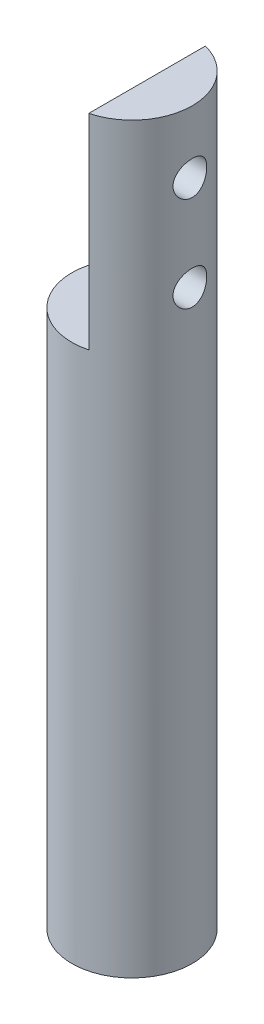
ISO-10303-21;
HEADER;
FILE_DESCRIPTION(('STEP AP214'),'2;1');
FILE_NAME('part.step','',(''),(''),'','','');
FILE_SCHEMA(('AUTOMOTIVE_DESIGN { 1 0 10303 214 1 1 1 1 }'));
ENDSEC;
DATA;
#1=APPLICATION_CONTEXT('core data for automotive mechanical design processes');
#2=APPLICATION_PROTOCOL_DEFINITION('international standard','automotive_design',2000,#1);
#3=PRODUCT_CONTEXT('',#1,'mechanical');
#4=PRODUCT('Part','Part','',(#3));
#5=PRODUCT_RELATED_PRODUCT_CATEGORY('part','',(#4));
#6=PRODUCT_DEFINITION_FORMATION('','',#4);
#7=PRODUCT_DEFINITION_CONTEXT('part definition',#1,'design');
#8=PRODUCT_DEFINITION('design','',#6,#7);
#9=PRODUCT_DEFINITION_SHAPE('','',#8);
#10=(LENGTH_UNIT() NAMED_UNIT(*) SI_UNIT(.MILLI.,.METRE.));
#11=(NAMED_UNIT(*) PLANE_ANGLE_UNIT() SI_UNIT($,.RADIAN.));
#12=(NAMED_UNIT(*) SI_UNIT($,.STERADIAN.) SOLID_ANGLE_UNIT());
#13=UNCERTAINTY_MEASURE_WITH_UNIT(LENGTH_MEASURE(1.E-05),#10,'distance_accuracy_value','');
#14=(GEOMETRIC_REPRESENTATION_CONTEXT(3) GLOBAL_UNCERTAINTY_ASSIGNED_CONTEXT((#13)) GLOBAL_UNIT_ASSIGNED_CONTEXT((#10,
#11,#12)) REPRESENTATION_CONTEXT('',''));
#15=CARTESIAN_POINT('',(0.,0.,0.));
#16=DIRECTION('',(0.,0.,1.));
#17=DIRECTION('',(1.,0.,0.));
#18=AXIS2_PLACEMENT_3D('',#15,#16,#17);
#19=CARTESIAN_POINT('',(0.,57.15,0.));
#20=DIRECTION('',(0.,-1.,0.));
#21=DIRECTION('',(0.,0.,-1.));
#22=AXIS2_PLACEMENT_3D('',#19,#20,#21);
#23=CYLINDRICAL_SURFACE('',#22,3.175);
#24=CARTESIAN_POINT('',(0.,57.15,0.));
#25=DIRECTION('',(0.,1.,0.));
#26=DIRECTION('',(0.,0.,1.));
#27=AXIS2_PLACEMENT_3D('',#24,#25,#26);
#28=CIRCLE('',#27,3.175);
#29=CARTESIAN_POINT('',(0.794,57.15,3.07411597048648));
#30=VERTEX_POINT('',#29);
#31=CARTESIAN_POINT('',(0.794,57.15,-3.07411597048648));
#32=VERTEX_POINT('',#31);
#33=EDGE_CURVE('E68',#30,#32,#28,.T.);
#34=ORIENTED_EDGE('',*,*,#33,.F.);
#35=DIRECTION('',(0.,-1.,0.));
#36=VECTOR('',#35,1.);
#37=CARTESIAN_POINT('',(0.794,57.15,3.07411597048648));
#38=LINE('',#37,#36);
#39=CARTESIAN_POINT('',(0.794,46.355,3.07411597048648));
#40=VERTEX_POINT('',#39);
#41=EDGE_CURVE('E52',#30,#40,#38,.T.);
#42=ORIENTED_EDGE('',*,*,#41,.T.);
#43=CARTESIAN_POINT('',(0.,46.355,0.));
#44=DIRECTION('',(0.,-1.,0.));
#45=DIRECTION('',(0.,0.,-1.));
#46=AXIS2_PLACEMENT_3D('',#43,#44,#45);
#47=CIRCLE('',#46,3.175);
#48=CARTESIAN_POINT('',(0.794,46.355,-3.07411597048648));
#49=VERTEX_POINT('',#48);
#50=EDGE_CURVE('E11',#40,#49,#47,.T.);
#51=ORIENTED_EDGE('',*,*,#50,.T.);
#52=DIRECTION('',(0.,-1.,0.));
#53=VECTOR('',#52,1.);
#54=CARTESIAN_POINT('',(0.794,57.15,-3.07411597048648));
#55=LINE('',#54,#53);
#56=EDGE_CURVE('E63',#49,#32,#55,.F.);
#57=ORIENTED_EDGE('',*,*,#56,.T.);
#58=EDGE_LOOP('',(#34,#42,#51,#57));
#59=FACE_BOUND('',#58,.T.);
#60=CARTESIAN_POINT('',(3.048,48.855,0.889));
#61=CARTESIAN_POINT('',(3.04800074144579,48.9038733654637,0.888999022704976));
#62=CARTESIAN_POINT('',(3.0491883536904,48.9527567364062,0.884956005900081));
#63=CARTESIAN_POINT('',(3.05379446473852,49.0491049848988,0.868925614211581));
#64=CARTESIAN_POINT('',(3.05721393512249,49.096569235257,0.856934779420127));
#65=CARTESIAN_POINT('',(3.06586679255467,49.1886712317961,0.825439260264913));
#66=CARTESIAN_POINT('',(3.07109744934927,49.2333131134177,0.80594588062788));
#67=CARTESIAN_POINT('',(3.08277975485952,49.3187015211283,0.760034756365591));
#68=CARTESIAN_POINT('',(3.0892315334209,49.3594476322734,0.733616275257372));
#69=CARTESIAN_POINT('',(3.10282851808416,49.4370111447716,0.673825649223519));
#70=CARTESIAN_POINT('',(3.10998700385331,49.4737052421073,0.640296533333315));
#71=CARTESIAN_POINT('',(3.12407666925912,49.5410299343499,0.567573542210273));
#72=CARTESIAN_POINT('',(3.13100782316884,49.5716598449399,0.528379028524615));
#73=CARTESIAN_POINT('',(3.14401109305889,49.6265090608122,0.444574237503616));
#74=CARTESIAN_POINT('',(3.15006572408435,49.6506045660182,0.399879985189847));
#75=CARTESIAN_POINT('',(3.16048064645674,49.6908915244846,0.306876342799879));
#76=CARTESIAN_POINT('',(3.16484125401579,49.7070844530113,0.25856762942083));
#77=CARTESIAN_POINT('',(3.17128288506878,49.7307040631926,0.160994613397917));
#78=CARTESIAN_POINT('',(3.17341843142117,49.7383407786606,0.111784817223569));
#79=CARTESIAN_POINT('',(3.17536048694193,49.7452932743306,0.0127392624770652));
#80=CARTESIAN_POINT('',(3.17516742430905,49.7446105843552,-0.0370963793271478));
#81=CARTESIAN_POINT('',(3.17251342098985,49.735088882728,-0.134512605209552));
#82=CARTESIAN_POINT('',(3.17011563326432,49.7264769888744,-0.182117374688842));
#83=CARTESIAN_POINT('',(3.16339697389186,49.7017098300263,-0.275176901920624));
#84=CARTESIAN_POINT('',(3.15907598732543,49.6855541142527,-0.320631531013265));
#85=CARTESIAN_POINT('',(3.14890524255914,49.6459918167282,-0.408664749201556));
#86=CARTESIAN_POINT('',(3.14303970776309,49.6225099164607,-0.451207592285721));
#87=CARTESIAN_POINT('',(3.1304081222126,49.5690202636264,-0.531824617738518));
#88=CARTESIAN_POINT('',(3.12364188079185,49.5390111284853,-0.569897850736415));
#89=CARTESIAN_POINT('',(3.10966917671264,49.472123673229,-0.641850826998317));
#90=CARTESIAN_POINT('',(3.1024555637627,49.4350476993962,-0.675545670788154));
#91=CARTESIAN_POINT('',(3.08860471608588,49.3556980560687,-0.736287397269028));
#92=CARTESIAN_POINT('',(3.0819675243892,49.3134239991019,-0.763333783924003));
#93=CARTESIAN_POINT('',(3.06999005425627,49.2244444097016,-0.810171227980407));
#94=CARTESIAN_POINT('',(3.06465973815351,49.1777083945775,-0.829907105431934));
#95=CARTESIAN_POINT('',(3.05602075215966,49.0813941993218,-0.86117844600627));
#96=CARTESIAN_POINT('',(3.05271152110212,49.0318168122998,-0.872716185537042));
#97=CARTESIAN_POINT('',(3.04861036820764,48.9329684098257,-0.88693469934459));
#98=CARTESIAN_POINT('',(3.04773950623862,48.8837405964397,-0.889893331949965));
#99=CARTESIAN_POINT('',(3.04839680667467,48.7854926125504,-0.887639246904802));
#100=CARTESIAN_POINT('',(3.04992468355344,48.7364724180303,-0.882427501789494));
#101=CARTESIAN_POINT('',(3.0551305705055,48.6411353392666,-0.864226581903411));
#102=CARTESIAN_POINT('',(3.05876110757367,48.5947828515507,-0.851408976918569));
#103=CARTESIAN_POINT('',(3.06771577424975,48.5048869252364,-0.818555399608297));
#104=CARTESIAN_POINT('',(3.07304014129867,48.4613438814956,-0.798518415218363));
#105=CARTESIAN_POINT('',(3.08494108557681,48.3771528913416,-0.751245255343617));
#106=CARTESIAN_POINT('',(3.09154455793357,48.336599053057,-0.723848410491955));
#107=CARTESIAN_POINT('',(3.10519857691837,48.2605624680078,-0.66282910075005));
#108=CARTESIAN_POINT('',(3.11224921630329,48.2250807783703,-0.629205341400975));
#109=CARTESIAN_POINT('',(3.12627846255595,48.1590184791837,-0.555393175540641));
#110=CARTESIAN_POINT('',(3.13324740753382,48.1286329109128,-0.515027982119802));
#111=CARTESIAN_POINT('',(3.14609634169483,48.0750663487539,-0.429610615302621));
#112=CARTESIAN_POINT('',(3.15197638840411,48.0518849742268,-0.384558689701355));
#113=CARTESIAN_POINT('',(3.16194727289417,48.013604157135,-0.291361546194213));
#114=CARTESIAN_POINT('',(3.16605159772319,47.9984435908583,-0.243242948857277));
#115=CARTESIAN_POINT('',(3.17206811720327,47.9764640428509,-0.145007590278837));
#116=CARTESIAN_POINT('',(3.17398085158866,47.969643007273,-0.094891324161075));
#117=CARTESIAN_POINT('',(3.17537031148508,47.9646756462352,0.00410257465857676));
#118=CARTESIAN_POINT('',(3.17492700643421,47.9662445579541,0.0529649880377312));
#119=CARTESIAN_POINT('',(3.17183800207679,47.9773438045136,0.149702046305527));
#120=CARTESIAN_POINT('',(3.1691924010422,47.9868737841116,0.197576735171222));
#121=CARTESIAN_POINT('',(3.16201473209881,48.0134573009097,0.290599820702147));
#122=CARTESIAN_POINT('',(3.15749847230393,48.0304478626725,0.335767515655424));
#123=CARTESIAN_POINT('',(3.14704937045711,48.071414238752,0.422636400107665));
#124=CARTESIAN_POINT('',(3.1411163150138,48.0953911054345,0.464337066141584));
#125=CARTESIAN_POINT('',(3.12825099335539,48.1504535292501,0.544392318898719));
#126=CARTESIAN_POINT('',(3.12129485795685,48.1817240427912,0.582615836411659));
#127=CARTESIAN_POINT('',(3.10725567651361,48.2501422555483,0.653368888845675));
#128=CARTESIAN_POINT('',(3.10017259641915,48.287291553173,0.68589687010055));
#129=CARTESIAN_POINT('',(3.08647631222338,48.3675262150993,0.745143293434857));
#130=CARTESIAN_POINT('',(3.07987922601124,48.4107364855654,0.771696671947967));
#131=CARTESIAN_POINT('',(3.0681400998246,48.5011873096253,0.817126280627679));
#132=CARTESIAN_POINT('',(3.06299720300363,48.5484254684335,0.836007034585142));
#133=CARTESIAN_POINT('',(3.05538486849526,48.638669406351,0.863376907077116));
#134=CARTESIAN_POINT('',(3.05263934900825,48.6813225211211,0.872961556556881));
#135=CARTESIAN_POINT('',(3.0489467122479,48.7676478578347,0.885773084342434));
#136=CARTESIAN_POINT('',(3.04799933734046,48.8113199328759,0.889000873447365));
#137=CARTESIAN_POINT('',(3.048,48.855,0.889));
#138=B_SPLINE_CURVE_WITH_KNOTS('',3,(#60,#61,#62,#63,#64,#65,#66,#67,#68,#69,#70,#71,#72,#73,
#74,#75,#76,#77,#78,#79,#80,#81,#82,#83,#84,#85,#86,#87,#88,#89,#90,#91,#92,#93,#94,#95,#96,#97,
#98,#99,#100,#101,#102,#103,#104,#105,#106,#107,#108,#109,#110,#111,#112,#113,#114,#115,#116,
#117,#118,#119,#120,#121,#122,#123,#124,#125,#126,#127,#128,#129,#130,#131,#132,#133,#134,#135,
#136,#137),.UNSPECIFIED.,.T.,.F.,(4,2,2,2,2,2,2,2,2,2,2,2,2,2,2,2,2,2,2,2,2,2,2,2,2,2,2,2,2,2,2,
2,2,2,2,2,2,2,4),(0.,0.146459287401067,0.292982374544872,0.439285541729908,0.585604274540455,
0.735571650820729,0.885555940626634,1.03820968127062,1.19083491334784,1.33962536162133,
1.48838844982117,1.63301874819052,1.77765769001139,1.923835554253,2.07004441154515,
2.22118784811516,2.37234255795564,2.52461599929671,2.6768471417545,2.82408956362907,
2.97131446029551,3.1153382232534,3.25938218435847,3.40687004300796,3.55438859610561,
3.70666622842306,3.85893581366485,4.01002765448382,4.1610822771287,4.30704320227681,
4.45299761463259,4.59774301104066,4.74251022211431,4.89144959773006,5.04042953893497,
5.19312385990269,5.3457280209917,5.47664325964223,5.60753973963556),.UNSPECIFIED.);
#139=CARTESIAN_POINT('',(3.048,48.855,0.889));
#140=VERTEX_POINT('',#139);
#141=EDGE_CURVE('E85',#140,#140,#138,.T.);
#142=ORIENTED_EDGE('',*,*,#141,.T.);
#143=EDGE_LOOP('',(#142));
#144=FACE_BOUND('',#143,.T.);
#145=CARTESIAN_POINT('',(3.048,53.855,0.889));
#146=CARTESIAN_POINT('',(3.04800074144579,53.9038733654637,0.888999022704975));
#147=CARTESIAN_POINT('',(3.0491883536904,53.9527567364062,0.884956005900081));
#148=CARTESIAN_POINT('',(3.05379446473852,54.0491049848988,0.86892561421158));
#149=CARTESIAN_POINT('',(3.05721393512249,54.096569235257,0.856934779420127));
#150=CARTESIAN_POINT('',(3.06586679255467,54.1886712317961,0.825439260264912));
#151=CARTESIAN_POINT('',(3.07109744934927,54.2333131134177,0.80594588062788));
#152=CARTESIAN_POINT('',(3.08277975485952,54.3187015211283,0.76003475636559));
#153=CARTESIAN_POINT('',(3.0892315334209,54.3594476322734,0.733616275257371));
#154=CARTESIAN_POINT('',(3.10282851808416,54.4370111447716,0.673825649223518));
#155=CARTESIAN_POINT('',(3.10998700385331,54.4737052421074,0.640296533333315));
#156=CARTESIAN_POINT('',(3.12407666925912,54.5410299343499,0.567573542210274));
#157=CARTESIAN_POINT('',(3.13100782316884,54.5716598449399,0.528379028524614));
#158=CARTESIAN_POINT('',(3.14401109305889,54.6265090608122,0.444574237503614));
#159=CARTESIAN_POINT('',(3.15006572408435,54.6506045660182,0.399879985189847));
#160=CARTESIAN_POINT('',(3.16048064645674,54.6908915244847,0.306876342799879));
#161=CARTESIAN_POINT('',(3.16484125401579,54.7070844530113,0.258567629420829));
#162=CARTESIAN_POINT('',(3.17128288506878,54.7307040631926,0.160994613397916));
#163=CARTESIAN_POINT('',(3.17341843142117,54.7383407786606,0.111784817223569));
#164=CARTESIAN_POINT('',(3.17536048694193,54.7452932743307,0.0127392624770647));
#165=CARTESIAN_POINT('',(3.17516742430905,54.7446105843552,-0.0370963793271483));
#166=CARTESIAN_POINT('',(3.17251342098985,54.735088882728,-0.134512605209552));
#167=CARTESIAN_POINT('',(3.17011563326432,54.7264769888744,-0.18211737468884));
#168=CARTESIAN_POINT('',(3.16339697389186,54.7017098300263,-0.275176901920622));
#169=CARTESIAN_POINT('',(3.15907598732543,54.6855541142527,-0.320631531013265));
#170=CARTESIAN_POINT('',(3.14890524255914,54.6459918167282,-0.408664749201556));
#171=CARTESIAN_POINT('',(3.14303970776309,54.6225099164607,-0.451207592285719));
#172=CARTESIAN_POINT('',(3.1304081222126,54.5690202636264,-0.531824617738516));
#173=CARTESIAN_POINT('',(3.12364188079185,54.5390111284853,-0.569897850736414));
#174=CARTESIAN_POINT('',(3.10966917671264,54.472123673229,-0.64185082699832));
#175=CARTESIAN_POINT('',(3.1024555637627,54.4350476993962,-0.675545670788159));
#176=CARTESIAN_POINT('',(3.08860471608588,54.3556980560687,-0.736287397269033));
#177=CARTESIAN_POINT('',(3.0819675243892,54.3134239991019,-0.763333783924004));
#178=CARTESIAN_POINT('',(3.06999005425627,54.2244444097016,-0.810171227980408));
#179=CARTESIAN_POINT('',(3.06465973815351,54.1777083945776,-0.829907105431936));
#180=CARTESIAN_POINT('',(3.05602075215966,54.0813941993218,-0.861178446006272));
#181=CARTESIAN_POINT('',(3.05271152110212,54.0318168122998,-0.872716185537043));
#182=CARTESIAN_POINT('',(3.04861036820764,53.9329684098257,-0.88693469934459));
#183=CARTESIAN_POINT('',(3.04773950623862,53.8837405964397,-0.889893331949965));
#184=CARTESIAN_POINT('',(3.04839680667467,53.7854926125504,-0.887639246904802));
#185=CARTESIAN_POINT('',(3.04992468355344,53.7364724180303,-0.882427501789495));
#186=CARTESIAN_POINT('',(3.0551305705055,53.6411353392666,-0.864226581903412));
#187=CARTESIAN_POINT('',(3.05876110757367,53.5947828515508,-0.851408976918569));
#188=CARTESIAN_POINT('',(3.06771577424975,53.5048869252364,-0.818555399608298));
#189=CARTESIAN_POINT('',(3.07304014129867,53.4613438814956,-0.798518415218364));
#190=CARTESIAN_POINT('',(3.08494108557681,53.3771528913416,-0.751245255343617));
#191=CARTESIAN_POINT('',(3.09154455793357,53.336599053057,-0.723848410491956));
#192=CARTESIAN_POINT('',(3.10519857691837,53.2605624680078,-0.662829100750051));
#193=CARTESIAN_POINT('',(3.11224921630329,53.2250807783703,-0.629205341400976));
#194=CARTESIAN_POINT('',(3.12627846255595,53.1590184791837,-0.555393175540642));
#195=CARTESIAN_POINT('',(3.13324740753382,53.1286329109128,-0.515027982119803));
#196=CARTESIAN_POINT('',(3.14609634169483,53.0750663487539,-0.429610615302622));
#197=CARTESIAN_POINT('',(3.15197638840411,53.0518849742268,-0.384558689701356));
#198=CARTESIAN_POINT('',(3.16194727289417,53.013604157135,-0.291361546194213));
#199=CARTESIAN_POINT('',(3.16605159772319,52.9984435908583,-0.243242948857278));
#200=CARTESIAN_POINT('',(3.17206811720327,52.9764640428509,-0.145007590278837));
#201=CARTESIAN_POINT('',(3.17398085158866,52.969643007273,-0.0948913241610756));
#202=CARTESIAN_POINT('',(3.17537031148508,52.9646756462352,0.00410257465857598));
#203=CARTESIAN_POINT('',(3.17492700643421,52.9662445579541,0.0529649880377303));
#204=CARTESIAN_POINT('',(3.17183800207679,52.9773438045136,0.149702046305526));
#205=CARTESIAN_POINT('',(3.1691924010422,52.9868737841116,0.197576735171222));
#206=CARTESIAN_POINT('',(3.16201473209881,53.0134573009097,0.290599820702145));
#207=CARTESIAN_POINT('',(3.15749847230393,53.0304478626725,0.335767515655421));
#208=CARTESIAN_POINT('',(3.14704937045711,53.071414238752,0.422636400107661));
#209=CARTESIAN_POINT('',(3.1411163150138,53.0953911054345,0.464337066141583));
#210=CARTESIAN_POINT('',(3.12825099335539,53.1504535292501,0.544392318898718));
#211=CARTESIAN_POINT('',(3.12129485795685,53.1817240427912,0.582615836411658));
#212=CARTESIAN_POINT('',(3.10725567651361,53.2501422555483,0.653368888845674));
#213=CARTESIAN_POINT('',(3.10017259641915,53.287291553173,0.68589687010055));
#214=CARTESIAN_POINT('',(3.08647631222338,53.3675262150993,0.745143293434857));
#215=CARTESIAN_POINT('',(3.07987922601124,53.4107364855654,0.771696671947966));
#216=CARTESIAN_POINT('',(3.06814009982461,53.5011873096254,0.817126280627679));
#217=CARTESIAN_POINT('',(3.06299720300363,53.5484254684335,0.836007034585141));
#218=CARTESIAN_POINT('',(3.05538486849526,53.638669406351,0.863376907077115));
#219=CARTESIAN_POINT('',(3.05263934900825,53.6813225211211,0.872961556556881));
#220=CARTESIAN_POINT('',(3.0489467122479,53.7676478578347,0.885773084342433));
#221=CARTESIAN_POINT('',(3.04799933734046,53.8113199328759,0.889000873447365));
#222=CARTESIAN_POINT('',(3.048,53.855,0.889));
#223=B_SPLINE_CURVE_WITH_KNOTS('',3,(#145,#146,#147,#148,#149,#150,#151,#152,#153,#154,#155,
#156,#157,#158,#159,#160,#161,#162,#163,#164,#165,#166,#167,#168,#169,#170,#171,#172,#173,#174,
#175,#176,#177,#178,#179,#180,#181,#182,#183,#184,#185,#186,#187,#188,#189,#190,#191,#192,#193,
#194,#195,#196,#197,#198,#199,#200,#201,#202,#203,#204,#205,#206,#207,#208,#209,#210,#211,#212,
#213,#214,#215,#216,#217,#218,#219,#220,#221,#222),.UNSPECIFIED.,.T.,.F.,(4,2,2,2,2,2,2,2,2,2,2,
2,2,2,2,2,2,2,2,2,2,2,2,2,2,2,2,2,2,2,2,2,2,2,2,2,2,2,4),(0.,0.146459287401067,
0.292982374544872,0.439285541729908,0.585604274540455,0.735571650820734,0.885555940626635,
1.03820968127062,1.19083491334784,1.33962536162133,1.48838844982117,1.63301874819051,
1.77765769001139,1.92383555425299,2.07004441154515,2.22118784811517,2.37234255795564,
2.52461599929672,2.6768471417545,2.82408956362908,2.97131446029551,3.1153382232534,
3.25938218435847,3.40687004300796,3.55438859610561,3.70666622842306,3.85893581366485,
4.01002765448382,4.1610822771287,4.30704320227681,4.45299761463259,4.59774301104066,
4.7425102221143,4.89144959773006,5.04042953893497,5.19312385990269,5.3457280209917,
5.47664325964223,5.60753973963556),.UNSPECIFIED.);
#224=CARTESIAN_POINT('',(3.048,53.855,0.889));
#225=VERTEX_POINT('',#224);
#226=EDGE_CURVE('E78',#225,#225,#223,.T.);
#227=ORIENTED_EDGE('',*,*,#226,.T.);
#228=EDGE_LOOP('',(#227));
#229=FACE_BOUND('',#228,.T.);
#230=CARTESIAN_POINT('',(0.,18.,0.));
#231=DIRECTION('',(0.,-1.,0.));
#232=DIRECTION('',(0.,0.,-1.));
#233=AXIS2_PLACEMENT_3D('',#230,#231,#232);
#234=CIRCLE('',#233,3.175);
#235=CARTESIAN_POINT('',(0.,18.,-3.175));
#236=VERTEX_POINT('',#235);
#237=EDGE_CURVE('E40',#236,#236,#234,.T.);
#238=ORIENTED_EDGE('',*,*,#237,.F.);
#239=EDGE_LOOP('',(#238));
#240=FACE_BOUND('',#239,.T.);
#241=ADVANCED_FACE('F36',(#59,#144,#229,#240),#23,.T.);
#242=CARTESIAN_POINT('',(0.,57.15,0.));
#243=DIRECTION('',(0.,1.,0.));
#244=DIRECTION('',(0.,0.,1.));
#245=AXIS2_PLACEMENT_3D('',#242,#243,#244);
#246=PLANE('',#245);
#247=DIRECTION('',(0.,0.,-1.));
#248=VECTOR('',#247,1.);
#249=CARTESIAN_POINT('',(0.794,57.15,0.));
#250=LINE('',#249,#248);
#251=EDGE_CURVE('E45',#30,#32,#250,.T.);
#252=ORIENTED_EDGE('',*,*,#251,.F.);
#253=ORIENTED_EDGE('',*,*,#33,.T.);
#254=EDGE_LOOP('',(#252,#253));
#255=FACE_BOUND('',#254,.T.);
#256=ADVANCED_FACE('F73',(#255),#246,.T.);
#257=CARTESIAN_POINT('',(0.,46.355,0.));
#258=DIRECTION('',(0.,-1.,0.));
#259=DIRECTION('',(0.,0.,-1.));
#260=AXIS2_PLACEMENT_3D('',#257,#258,#259);
#261=PLANE('',#260);
#262=ORIENTED_EDGE('',*,*,#50,.F.);
#263=DIRECTION('',(0.,0.,-1.));
#264=VECTOR('',#263,1.);
#265=CARTESIAN_POINT('',(0.794,46.355,-3.175));
#266=LINE('',#265,#264);
#267=EDGE_CURVE('E71',#40,#49,#266,.T.);
#268=ORIENTED_EDGE('',*,*,#267,.T.);
#269=EDGE_LOOP('',(#262,#268));
#270=FACE_BOUND('',#269,.T.);
#271=ADVANCED_FACE('F102',(#270),#261,.F.);
#272=CARTESIAN_POINT('',(0.794,46.355,-3.175));
#273=DIRECTION('',(1.,0.,0.));
#274=DIRECTION('',(0.,0.,-1.));
#275=AXIS2_PLACEMENT_3D('',#272,#273,#274);
#276=PLANE('',#275);
#277=CARTESIAN_POINT('',(0.794,53.855,0.));
#278=DIRECTION('',(-1.,0.,0.));
#279=DIRECTION('',(0.,0.,1.));
#280=AXIS2_PLACEMENT_3D('',#277,#278,#279);
#281=CIRCLE('',#280,0.888999999999999);
#282=CARTESIAN_POINT('',(0.794,53.855,0.889));
#283=VERTEX_POINT('',#282);
#284=EDGE_CURVE('E159',#283,#283,#281,.T.);
#285=ORIENTED_EDGE('',*,*,#284,.F.);
#286=EDGE_LOOP('',(#285));
#287=FACE_BOUND('',#286,.T.);
#288=CARTESIAN_POINT('',(0.794,48.855,0.));
#289=DIRECTION('',(-1.,0.,0.));
#290=DIRECTION('',(0.,0.,1.));
#291=AXIS2_PLACEMENT_3D('',#288,#289,#290);
#292=CIRCLE('',#291,0.888999999999999);
#293=CARTESIAN_POINT('',(0.794,48.855,0.889));
#294=VERTEX_POINT('',#293);
#295=EDGE_CURVE('E157',#294,#294,#292,.T.);
#296=ORIENTED_EDGE('',*,*,#295,.F.);
#297=EDGE_LOOP('',(#296));
#298=FACE_BOUND('',#297,.T.);
#299=ORIENTED_EDGE('',*,*,#251,.T.);
#300=ORIENTED_EDGE('',*,*,#56,.F.);
#301=ORIENTED_EDGE('',*,*,#267,.F.);
#302=ORIENTED_EDGE('',*,*,#41,.F.);
#303=EDGE_LOOP('',(#299,#300,#301,#302));
#304=FACE_BOUND('',#303,.T.);
#305=ADVANCED_FACE('F62',(#287,#298,#304),#276,.F.);
#306=CARTESIAN_POINT('',(11.589,48.855,0.));
#307=DIRECTION('',(-1.,0.,0.));
#308=DIRECTION('',(0.,0.,1.));
#309=AXIS2_PLACEMENT_3D('',#306,#307,#308);
#310=CYLINDRICAL_SURFACE('',#309,0.888999999999999);
#311=ORIENTED_EDGE('',*,*,#295,.T.);
#312=EDGE_LOOP('',(#311));
#313=FACE_BOUND('',#312,.T.);
#314=ORIENTED_EDGE('',*,*,#141,.F.);
#315=EDGE_LOOP('',(#314));
#316=FACE_BOUND('',#315,.T.);
#317=ADVANCED_FACE('F96',(#313,#316),#310,.F.);
#318=CARTESIAN_POINT('',(11.589,53.855,0.));
#319=DIRECTION('',(-1.,0.,0.));
#320=DIRECTION('',(0.,0.,1.));
#321=AXIS2_PLACEMENT_3D('',#318,#319,#320);
#322=CYLINDRICAL_SURFACE('',#321,0.888999999999999);
#323=ORIENTED_EDGE('',*,*,#284,.T.);
#324=EDGE_LOOP('',(#323));
#325=FACE_BOUND('',#324,.T.);
#326=ORIENTED_EDGE('',*,*,#226,.F.);
#327=EDGE_LOOP('',(#326));
#328=FACE_BOUND('',#327,.T.);
#329=ADVANCED_FACE('F91',(#325,#328),#322,.F.);
#330=CARTESIAN_POINT('',(0.,18.,0.));
#331=DIRECTION('',(0.,-1.,0.));
#332=DIRECTION('',(0.,0.,-1.));
#333=AXIS2_PLACEMENT_3D('',#330,#331,#332);
#334=PLANE('',#333);
#335=ORIENTED_EDGE('',*,*,#237,.T.);
#336=EDGE_LOOP('',(#335));
#337=FACE_BOUND('',#336,.T.);
#338=ADVANCED_FACE('F95',(#337),#334,.T.);
#339=CLOSED_SHELL('',(#241,#256,#271,#305,#317,#329,#338));
#340=MANIFOLD_SOLID_BREP('B2',#339);
#341=ADVANCED_BREP_SHAPE_REPRESENTATION('',(#18,#340),#14);
#342=SHAPE_DEFINITION_REPRESENTATION(#9,#341);
ENDSEC;
END-ISO-10303-21;
